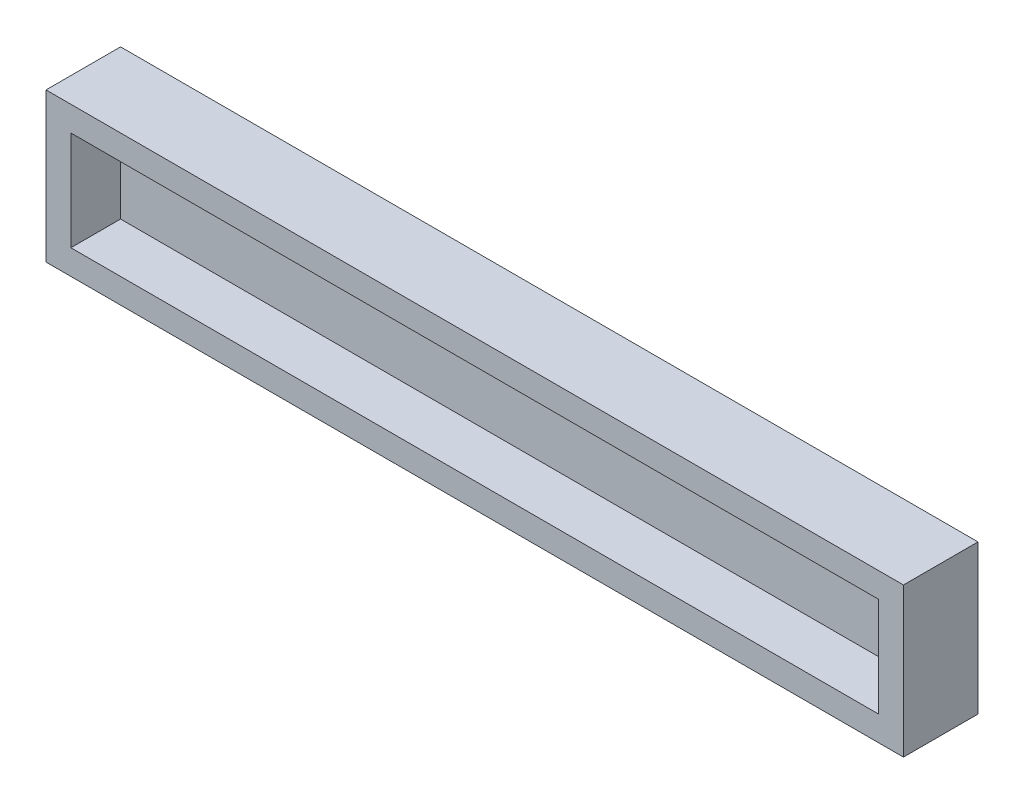
ISO-10303-21;
HEADER;
FILE_DESCRIPTION(('STEP AP214'),'2;1');
FILE_NAME('part.step','',(''),(''),'','','');
FILE_SCHEMA(('AUTOMOTIVE_DESIGN { 1 0 10303 214 1 1 1 1 }'));
ENDSEC;
DATA;
#1=APPLICATION_CONTEXT('core data for automotive mechanical design processes');
#2=APPLICATION_PROTOCOL_DEFINITION('international standard','automotive_design',2000,#1);
#3=PRODUCT_CONTEXT('',#1,'mechanical');
#4=PRODUCT('Part','Part','',(#3));
#5=PRODUCT_RELATED_PRODUCT_CATEGORY('part','',(#4));
#6=PRODUCT_DEFINITION_FORMATION('','',#4);
#7=PRODUCT_DEFINITION_CONTEXT('part definition',#1,'design');
#8=PRODUCT_DEFINITION('design','',#6,#7);
#9=PRODUCT_DEFINITION_SHAPE('','',#8);
#10=(LENGTH_UNIT() NAMED_UNIT(*) SI_UNIT(.MILLI.,.METRE.));
#11=(NAMED_UNIT(*) PLANE_ANGLE_UNIT() SI_UNIT($,.RADIAN.));
#12=(NAMED_UNIT(*) SI_UNIT($,.STERADIAN.) SOLID_ANGLE_UNIT());
#13=UNCERTAINTY_MEASURE_WITH_UNIT(LENGTH_MEASURE(1.E-05),#10,'distance_accuracy_value','');
#14=(GEOMETRIC_REPRESENTATION_CONTEXT(3) GLOBAL_UNCERTAINTY_ASSIGNED_CONTEXT((#13)) GLOBAL_UNIT_ASSIGNED_CONTEXT((#10,
#11,#12)) REPRESENTATION_CONTEXT('',''));
#15=CARTESIAN_POINT('',(0.,0.,0.));
#16=DIRECTION('',(0.,0.,1.));
#17=DIRECTION('',(1.,0.,0.));
#18=AXIS2_PLACEMENT_3D('',#15,#16,#17);
#19=CARTESIAN_POINT('',(0.,0.,3.));
#20=DIRECTION('',(0.,0.,-1.));
#21=DIRECTION('',(-1.,0.,0.));
#22=AXIS2_PLACEMENT_3D('',#19,#20,#21);
#23=PLANE('',#22);
#24=DIRECTION('',(0.,-1.,0.));
#25=VECTOR('',#24,1.);
#26=CARTESIAN_POINT('',(0.,0.,3.));
#27=LINE('',#26,#25);
#28=CARTESIAN_POINT('',(0.,12.,3.));
#29=VERTEX_POINT('',#28);
#30=CARTESIAN_POINT('',(0.,0.,3.));
#31=VERTEX_POINT('',#30);
#32=EDGE_CURVE('E143',#29,#31,#27,.T.);
#33=ORIENTED_EDGE('',*,*,#32,.T.);
#34=DIRECTION('',(1.,0.,0.));
#35=VECTOR('',#34,1.);
#36=CARTESIAN_POINT('',(0.,0.,3.));
#37=LINE('',#36,#35);
#38=CARTESIAN_POINT('',(97.5,0.,3.));
#39=VERTEX_POINT('',#38);
#40=EDGE_CURVE('E146',#31,#39,#37,.T.);
#41=ORIENTED_EDGE('',*,*,#40,.T.);
#42=DIRECTION('',(0.,1.,0.));
#43=VECTOR('',#42,1.);
#44=CARTESIAN_POINT('',(97.5,0.,3.));
#45=LINE('',#44,#43);
#46=CARTESIAN_POINT('',(97.5,12.,3.));
#47=VERTEX_POINT('',#46);
#48=EDGE_CURVE('E43',#39,#47,#45,.T.);
#49=ORIENTED_EDGE('',*,*,#48,.T.);
#50=DIRECTION('',(-1.,0.,0.));
#51=VECTOR('',#50,1.);
#52=CARTESIAN_POINT('',(0.,12.,3.));
#53=LINE('',#52,#51);
#54=EDGE_CURVE('E12',#47,#29,#53,.T.);
#55=ORIENTED_EDGE('',*,*,#54,.T.);
#56=EDGE_LOOP('',(#33,#41,#49,#55));
#57=FACE_BOUND('',#56,.T.);
#58=ADVANCED_FACE('F35',(#57),#23,.F.);
#59=CARTESIAN_POINT('',(0.,12.,120.053557769359));
#60=DIRECTION('',(0.,1.,0.));
#61=DIRECTION('',(0.,0.,1.));
#62=AXIS2_PLACEMENT_3D('',#59,#60,#61);
#63=PLANE('',#62);
#64=DIRECTION('',(0.,0.,-1.));
#65=VECTOR('',#64,1.);
#66=CARTESIAN_POINT('',(0.,12.,120.053557769359));
#67=LINE('',#66,#65);
#68=CARTESIAN_POINT('',(0.,12.,9.00000000000001));
#69=VERTEX_POINT('',#68);
#70=EDGE_CURVE('E129',#69,#29,#67,.T.);
#71=ORIENTED_EDGE('',*,*,#70,.T.);
#72=ORIENTED_EDGE('',*,*,#54,.F.);
#73=DIRECTION('',(0.,0.,-1.));
#74=VECTOR('',#73,1.);
#75=CARTESIAN_POINT('',(97.5,12.,120.053557769359));
#76=LINE('',#75,#74);
#77=CARTESIAN_POINT('',(97.5,12.,9.00000000000001));
#78=VERTEX_POINT('',#77);
#79=EDGE_CURVE('E157',#78,#47,#76,.T.);
#80=ORIENTED_EDGE('',*,*,#79,.F.);
#81=DIRECTION('',(-1.,0.,0.));
#82=VECTOR('',#81,1.);
#83=CARTESIAN_POINT('',(0.,12.,9.00000000000001));
#84=LINE('',#83,#82);
#85=EDGE_CURVE('E136',#78,#69,#84,.T.);
#86=ORIENTED_EDGE('',*,*,#85,.T.);
#87=EDGE_LOOP('',(#71,#72,#80,#86));
#88=FACE_BOUND('',#87,.T.);
#89=ADVANCED_FACE('F173',(#88),#63,.F.);
#90=CARTESIAN_POINT('',(97.5,0.,120.053557769359));
#91=DIRECTION('',(1.,0.,0.));
#92=DIRECTION('',(0.,0.,-1.));
#93=AXIS2_PLACEMENT_3D('',#90,#91,#92);
#94=PLANE('',#93);
#95=ORIENTED_EDGE('',*,*,#79,.T.);
#96=ORIENTED_EDGE('',*,*,#48,.F.);
#97=DIRECTION('',(0.,0.,-1.));
#98=VECTOR('',#97,1.);
#99=CARTESIAN_POINT('',(97.5,0.,120.053557769359));
#100=LINE('',#99,#98);
#101=CARTESIAN_POINT('',(97.5,0.,9.00000000000001));
#102=VERTEX_POINT('',#101);
#103=EDGE_CURVE('E126',#102,#39,#100,.T.);
#104=ORIENTED_EDGE('',*,*,#103,.F.);
#105=DIRECTION('',(0.,1.,0.));
#106=VECTOR('',#105,1.);
#107=CARTESIAN_POINT('',(97.5,0.,9.00000000000001));
#108=LINE('',#107,#106);
#109=EDGE_CURVE('E169',#102,#78,#108,.T.);
#110=ORIENTED_EDGE('',*,*,#109,.T.);
#111=EDGE_LOOP('',(#95,#96,#104,#110));
#112=FACE_BOUND('',#111,.T.);
#113=ADVANCED_FACE('F154',(#112),#94,.F.);
#114=CARTESIAN_POINT('',(0.,0.,120.053557769359));
#115=DIRECTION('',(0.,-1.,0.));
#116=DIRECTION('',(0.,0.,-1.));
#117=AXIS2_PLACEMENT_3D('',#114,#115,#116);
#118=PLANE('',#117);
#119=ORIENTED_EDGE('',*,*,#103,.T.);
#120=ORIENTED_EDGE('',*,*,#40,.F.);
#121=DIRECTION('',(0.,0.,-1.));
#122=VECTOR('',#121,1.);
#123=CARTESIAN_POINT('',(0.,0.,120.053557769359));
#124=LINE('',#123,#122);
#125=CARTESIAN_POINT('',(0.,0.,9.00000000000001));
#126=VERTEX_POINT('',#125);
#127=EDGE_CURVE('E50',#126,#31,#124,.T.);
#128=ORIENTED_EDGE('',*,*,#127,.F.);
#129=DIRECTION('',(1.,0.,0.));
#130=VECTOR('',#129,1.);
#131=CARTESIAN_POINT('',(0.,0.,9.00000000000001));
#132=LINE('',#131,#130);
#133=EDGE_CURVE('E160',#126,#102,#132,.T.);
#134=ORIENTED_EDGE('',*,*,#133,.T.);
#135=EDGE_LOOP('',(#119,#120,#128,#134));
#136=FACE_BOUND('',#135,.T.);
#137=ADVANCED_FACE('F159',(#136),#118,.F.);
#138=CARTESIAN_POINT('',(0.,0.,120.053557769359));
#139=DIRECTION('',(-1.,0.,0.));
#140=DIRECTION('',(0.,0.,1.));
#141=AXIS2_PLACEMENT_3D('',#138,#139,#140);
#142=PLANE('',#141);
#143=ORIENTED_EDGE('',*,*,#127,.T.);
#144=ORIENTED_EDGE('',*,*,#32,.F.);
#145=ORIENTED_EDGE('',*,*,#70,.F.);
#146=DIRECTION('',(0.,-1.,0.));
#147=VECTOR('',#146,1.);
#148=CARTESIAN_POINT('',(0.,0.,9.00000000000001));
#149=LINE('',#148,#147);
#150=EDGE_CURVE('E164',#69,#126,#149,.T.);
#151=ORIENTED_EDGE('',*,*,#150,.T.);
#152=EDGE_LOOP('',(#143,#144,#145,#151));
#153=FACE_BOUND('',#152,.T.);
#154=ADVANCED_FACE('F176',(#153),#142,.F.);
#155=CARTESIAN_POINT('',(-3.,15.,120.053557769359));
#156=DIRECTION('',(0.,1.,0.));
#157=DIRECTION('',(-1.,0.,0.));
#158=AXIS2_PLACEMENT_3D('',#155,#156,#157);
#159=PLANE('',#158);
#160=DIRECTION('',(-1.,0.,0.));
#161=VECTOR('',#160,1.);
#162=CARTESIAN_POINT('',(-3.,15.,9.00000000000001));
#163=LINE('',#162,#161);
#164=CARTESIAN_POINT('',(100.5,15.,9.00000000000001));
#165=VERTEX_POINT('',#164);
#166=CARTESIAN_POINT('',(-3.,15.,9.00000000000001));
#167=VERTEX_POINT('',#166);
#168=EDGE_CURVE('E147',#165,#167,#163,.T.);
#169=ORIENTED_EDGE('',*,*,#168,.F.);
#170=DIRECTION('',(0.,0.,-1.));
#171=VECTOR('',#170,1.);
#172=CARTESIAN_POINT('',(100.5,15.,120.053557769359));
#173=LINE('',#172,#171);
#174=CARTESIAN_POINT('',(100.5,15.,0.));
#175=VERTEX_POINT('',#174);
#176=EDGE_CURVE('E112',#165,#175,#173,.T.);
#177=ORIENTED_EDGE('',*,*,#176,.T.);
#178=DIRECTION('',(1.,0.,0.));
#179=VECTOR('',#178,1.);
#180=CARTESIAN_POINT('',(-3.,15.,0.));
#181=LINE('',#180,#179);
#182=CARTESIAN_POINT('',(-3.,15.,0.));
#183=VERTEX_POINT('',#182);
#184=EDGE_CURVE('E116',#183,#175,#181,.T.);
#185=ORIENTED_EDGE('',*,*,#184,.F.);
#186=DIRECTION('',(0.,0.,-1.));
#187=VECTOR('',#186,1.);
#188=CARTESIAN_POINT('',(-3.,15.,120.053557769359));
#189=LINE('',#188,#187);
#190=EDGE_CURVE('E102',#167,#183,#189,.T.);
#191=ORIENTED_EDGE('',*,*,#190,.F.);
#192=EDGE_LOOP('',(#169,#177,#185,#191));
#193=FACE_BOUND('',#192,.T.);
#194=ADVANCED_FACE('F117',(#193),#159,.T.);
#195=CARTESIAN_POINT('',(100.5,-3.00000000000001,120.053557769359));
#196=DIRECTION('',(1.,0.,0.));
#197=DIRECTION('',(0.,0.,-1.));
#198=AXIS2_PLACEMENT_3D('',#195,#196,#197);
#199=PLANE('',#198);
#200=DIRECTION('',(0.,1.,0.));
#201=VECTOR('',#200,1.);
#202=CARTESIAN_POINT('',(100.5,-3.00000000000001,9.00000000000001));
#203=LINE('',#202,#201);
#204=CARTESIAN_POINT('',(100.5,-3.00000000000001,9.00000000000001));
#205=VERTEX_POINT('',#204);
#206=EDGE_CURVE('E142',#205,#165,#203,.T.);
#207=ORIENTED_EDGE('',*,*,#206,.F.);
#208=DIRECTION('',(0.,0.,-1.));
#209=VECTOR('',#208,1.);
#210=CARTESIAN_POINT('',(100.5,-3.00000000000001,120.053557769359));
#211=LINE('',#210,#209);
#212=CARTESIAN_POINT('',(100.5,-3.00000000000001,0.));
#213=VERTEX_POINT('',#212);
#214=EDGE_CURVE('E137',#205,#213,#211,.T.);
#215=ORIENTED_EDGE('',*,*,#214,.T.);
#216=DIRECTION('',(0.,-1.,0.));
#217=VECTOR('',#216,1.);
#218=CARTESIAN_POINT('',(100.5,-3.00000000000001,0.));
#219=LINE('',#218,#217);
#220=EDGE_CURVE('E122',#175,#213,#219,.T.);
#221=ORIENTED_EDGE('',*,*,#220,.F.);
#222=ORIENTED_EDGE('',*,*,#176,.F.);
#223=EDGE_LOOP('',(#207,#215,#221,#222));
#224=FACE_BOUND('',#223,.T.);
#225=ADVANCED_FACE('F183',(#224),#199,.T.);
#226=CARTESIAN_POINT('',(-3.,-3.,120.053557769359));
#227=DIRECTION('',(0.,-1.,0.));
#228=DIRECTION('',(1.,0.,0.));
#229=AXIS2_PLACEMENT_3D('',#226,#227,#228);
#230=PLANE('',#229);
#231=DIRECTION('',(1.,0.,0.));
#232=VECTOR('',#231,1.);
#233=CARTESIAN_POINT('',(-3.,-3.,9.00000000000001));
#234=LINE('',#233,#232);
#235=CARTESIAN_POINT('',(-3.,-3.,9.00000000000001));
#236=VERTEX_POINT('',#235);
#237=EDGE_CURVE('E165',#236,#205,#234,.T.);
#238=ORIENTED_EDGE('',*,*,#237,.F.);
#239=DIRECTION('',(0.,0.,-1.));
#240=VECTOR('',#239,1.);
#241=CARTESIAN_POINT('',(-3.,-3.,120.053557769359));
#242=LINE('',#241,#240);
#243=CARTESIAN_POINT('',(-3.,-3.,0.));
#244=VERTEX_POINT('',#243);
#245=EDGE_CURVE('E134',#236,#244,#242,.T.);
#246=ORIENTED_EDGE('',*,*,#245,.T.);
#247=DIRECTION('',(-1.,0.,0.));
#248=VECTOR('',#247,1.);
#249=CARTESIAN_POINT('',(-3.,-3.,0.));
#250=LINE('',#249,#248);
#251=EDGE_CURVE('E113',#213,#244,#250,.T.);
#252=ORIENTED_EDGE('',*,*,#251,.F.);
#253=ORIENTED_EDGE('',*,*,#214,.F.);
#254=EDGE_LOOP('',(#238,#246,#252,#253));
#255=FACE_BOUND('',#254,.T.);
#256=ADVANCED_FACE('F194',(#255),#230,.T.);
#257=CARTESIAN_POINT('',(-3.,-3.,120.053557769359));
#258=DIRECTION('',(-1.,0.,0.));
#259=DIRECTION('',(0.,0.,1.));
#260=AXIS2_PLACEMENT_3D('',#257,#258,#259);
#261=PLANE('',#260);
#262=DIRECTION('',(0.,-1.,0.));
#263=VECTOR('',#262,1.);
#264=CARTESIAN_POINT('',(-3.,-3.,9.00000000000001));
#265=LINE('',#264,#263);
#266=EDGE_CURVE('E109',#167,#236,#265,.T.);
#267=ORIENTED_EDGE('',*,*,#266,.F.);
#268=ORIENTED_EDGE('',*,*,#190,.T.);
#269=DIRECTION('',(0.,1.,0.));
#270=VECTOR('',#269,1.);
#271=CARTESIAN_POINT('',(-3.,-3.,0.));
#272=LINE('',#271,#270);
#273=EDGE_CURVE('E107',#244,#183,#272,.T.);
#274=ORIENTED_EDGE('',*,*,#273,.F.);
#275=ORIENTED_EDGE('',*,*,#245,.F.);
#276=EDGE_LOOP('',(#267,#268,#274,#275));
#277=FACE_BOUND('',#276,.T.);
#278=ADVANCED_FACE('F104',(#277),#261,.T.);
#279=CARTESIAN_POINT('',(0.,0.,9.));
#280=DIRECTION('',(0.,0.,-1.));
#281=DIRECTION('',(-1.,0.,0.));
#282=AXIS2_PLACEMENT_3D('',#279,#280,#281);
#283=PLANE('',#282);
#284=ORIENTED_EDGE('',*,*,#266,.T.);
#285=ORIENTED_EDGE('',*,*,#237,.T.);
#286=ORIENTED_EDGE('',*,*,#206,.T.);
#287=ORIENTED_EDGE('',*,*,#168,.T.);
#288=EDGE_LOOP('',(#284,#285,#286,#287));
#289=FACE_BOUND('',#288,.T.);
#290=ORIENTED_EDGE('',*,*,#85,.F.);
#291=ORIENTED_EDGE('',*,*,#109,.F.);
#292=ORIENTED_EDGE('',*,*,#133,.F.);
#293=ORIENTED_EDGE('',*,*,#150,.F.);
#294=EDGE_LOOP('',(#290,#291,#292,#293));
#295=FACE_BOUND('',#294,.T.);
#296=ADVANCED_FACE('F175',(#289,#295),#283,.F.);
#297=CARTESIAN_POINT('',(0.,0.,0.));
#298=DIRECTION('',(0.,0.,-1.));
#299=DIRECTION('',(-1.,0.,0.));
#300=AXIS2_PLACEMENT_3D('',#297,#298,#299);
#301=PLANE('',#300);
#302=ORIENTED_EDGE('',*,*,#273,.T.);
#303=ORIENTED_EDGE('',*,*,#184,.T.);
#304=ORIENTED_EDGE('',*,*,#220,.T.);
#305=ORIENTED_EDGE('',*,*,#251,.T.);
#306=EDGE_LOOP('',(#302,#303,#304,#305));
#307=FACE_BOUND('',#306,.T.);
#308=ADVANCED_FACE('F37',(#307),#301,.T.);
#309=CLOSED_SHELL('',(#58,#89,#113,#137,#154,#194,#225,#256,#278,#296,#308));
#310=MANIFOLD_SOLID_BREP('B2',#309);
#311=ADVANCED_BREP_SHAPE_REPRESENTATION('',(#18,#310),#14);
#312=SHAPE_DEFINITION_REPRESENTATION(#9,#311);
ENDSEC;
END-ISO-10303-21;
